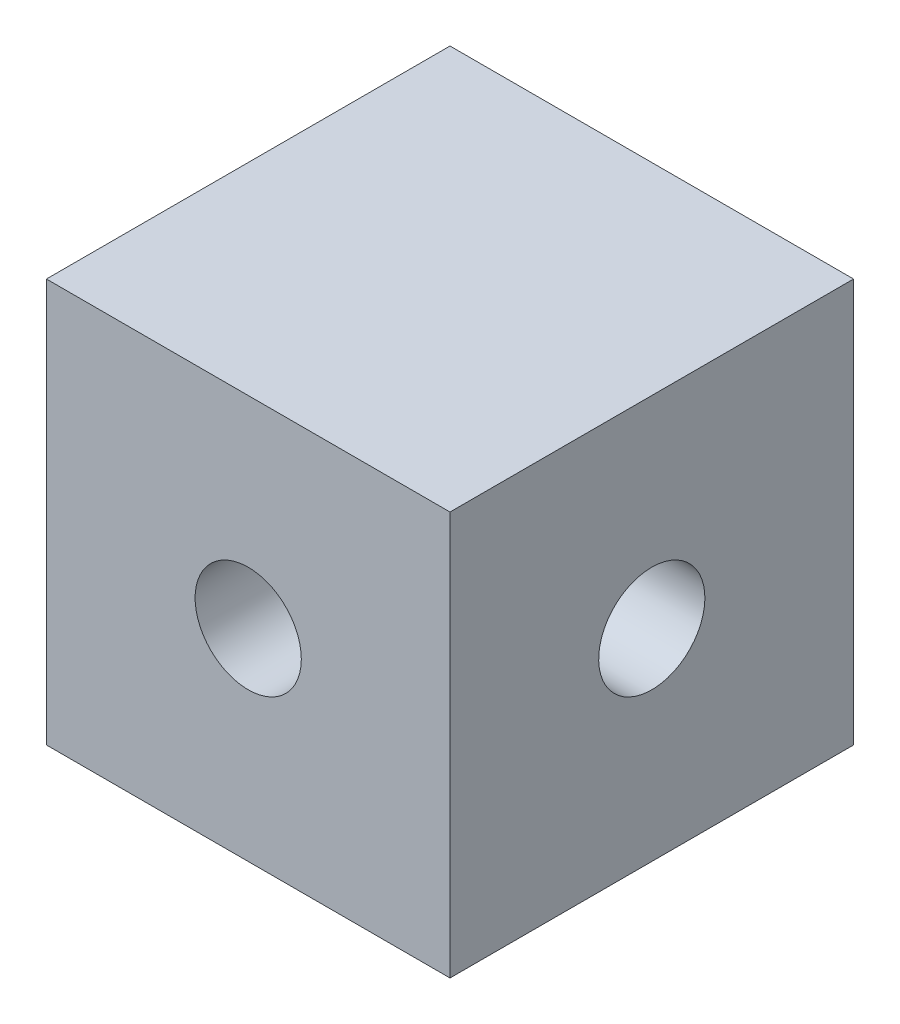
ISO-10303-21;
HEADER;
FILE_DESCRIPTION(('STEP AP214'),'2;1');
FILE_NAME('part.step','',(''),(''),'','','');
FILE_SCHEMA(('AUTOMOTIVE_DESIGN { 1 0 10303 214 1 1 1 1 }'));
ENDSEC;
DATA;
#1=APPLICATION_CONTEXT('core data for automotive mechanical design processes');
#2=APPLICATION_PROTOCOL_DEFINITION('international standard','automotive_design',2000,#1);
#3=PRODUCT_CONTEXT('',#1,'mechanical');
#4=PRODUCT('Part','Part','',(#3));
#5=PRODUCT_RELATED_PRODUCT_CATEGORY('part','',(#4));
#6=PRODUCT_DEFINITION_FORMATION('','',#4);
#7=PRODUCT_DEFINITION_CONTEXT('part definition',#1,'design');
#8=PRODUCT_DEFINITION('design','',#6,#7);
#9=PRODUCT_DEFINITION_SHAPE('','',#8);
#10=(LENGTH_UNIT() NAMED_UNIT(*) SI_UNIT(.MILLI.,.METRE.));
#11=(NAMED_UNIT(*) PLANE_ANGLE_UNIT() SI_UNIT($,.RADIAN.));
#12=(NAMED_UNIT(*) SI_UNIT($,.STERADIAN.) SOLID_ANGLE_UNIT());
#13=UNCERTAINTY_MEASURE_WITH_UNIT(LENGTH_MEASURE(1.E-05),#10,'distance_accuracy_value','');
#14=(GEOMETRIC_REPRESENTATION_CONTEXT(3) GLOBAL_UNCERTAINTY_ASSIGNED_CONTEXT((#13)) GLOBAL_UNIT_ASSIGNED_CONTEXT((#10,
#11,#12)) REPRESENTATION_CONTEXT('',''));
#15=CARTESIAN_POINT('',(0.,0.,0.));
#16=DIRECTION('',(0.,0.,1.));
#17=DIRECTION('',(1.,0.,0.));
#18=AXIS2_PLACEMENT_3D('',#15,#16,#17);
#19=CARTESIAN_POINT('',(0.,0.,-15.5));
#20=DIRECTION('',(0.,0.,1.));
#21=DIRECTION('',(1.,0.,0.));
#22=AXIS2_PLACEMENT_3D('',#19,#20,#21);
#23=CYLINDRICAL_SURFACE('',#22,2.5);
#24=CARTESIAN_POINT('',(0.,0.,9.5));
#25=DIRECTION('',(0.,0.,1.));
#26=DIRECTION('',(1.,0.,0.));
#27=AXIS2_PLACEMENT_3D('',#24,#25,#26);
#28=CIRCLE('',#27,2.5);
#29=CARTESIAN_POINT('',(2.5,0.,9.5));
#30=VERTEX_POINT('',#29);
#31=EDGE_CURVE('E118',#30,#30,#28,.T.);
#32=ORIENTED_EDGE('',*,*,#31,.T.);
#33=EDGE_LOOP('',(#32));
#34=FACE_BOUND('',#33,.T.);
#35=CARTESIAN_POINT('',(0.,0.,0.));
#36=DIRECTION('',(-0.707106781186547,0.,0.707106781186547));
#37=DIRECTION('',(0.707106781186547,0.,0.707106781186547));
#38=AXIS2_PLACEMENT_3D('',#35,#36,#37);
#39=ELLIPSE('',#38,3.53553390593274,2.5);
#40=CARTESIAN_POINT('',(0.,2.5,0.));
#41=VERTEX_POINT('',#40);
#42=CARTESIAN_POINT('',(0.,-2.5,0.));
#43=VERTEX_POINT('',#42);
#44=EDGE_CURVE('E53',#41,#43,#39,.F.);
#45=ORIENTED_EDGE('',*,*,#44,.T.);
#46=CARTESIAN_POINT('',(0.,0.,0.));
#47=DIRECTION('',(0.707106781186547,0.,0.707106781186547));
#48=DIRECTION('',(-0.707106781186547,0.,0.707106781186547));
#49=AXIS2_PLACEMENT_3D('',#46,#47,#48);
#50=ELLIPSE('',#49,3.53553390593274,2.5);
#51=EDGE_CURVE('E11',#43,#41,#50,.F.);
#52=ORIENTED_EDGE('',*,*,#51,.T.);
#53=EDGE_LOOP('',(#45,#52));
#54=FACE_BOUND('',#53,.T.);
#55=ADVANCED_FACE('F39',(#34,#54),#23,.F.);
#56=CARTESIAN_POINT('',(9.5,9.5,9.5));
#57=DIRECTION('',(-1.,0.,0.));
#58=DIRECTION('',(0.,-1.,0.));
#59=AXIS2_PLACEMENT_3D('',#56,#57,#58);
#60=PLANE('',#59);
#61=CARTESIAN_POINT('',(9.5,0.,0.));
#62=DIRECTION('',(1.,0.,0.));
#63=DIRECTION('',(0.,1.,0.));
#64=AXIS2_PLACEMENT_3D('',#61,#62,#63);
#65=CIRCLE('',#64,2.5);
#66=CARTESIAN_POINT('',(9.5,2.5,0.));
#67=VERTEX_POINT('',#66);
#68=EDGE_CURVE('E159',#67,#67,#65,.T.);
#69=ORIENTED_EDGE('',*,*,#68,.F.);
#70=EDGE_LOOP('',(#69));
#71=FACE_BOUND('',#70,.T.);
#72=DIRECTION('',(0.,1.,0.));
#73=VECTOR('',#72,1.);
#74=CARTESIAN_POINT('',(9.5,9.5,-9.5));
#75=LINE('',#74,#73);
#76=CARTESIAN_POINT('',(9.5,-9.5,-9.5));
#77=VERTEX_POINT('',#76);
#78=CARTESIAN_POINT('',(9.5,9.5,-9.5));
#79=VERTEX_POINT('',#78);
#80=EDGE_CURVE('E117',#77,#79,#75,.T.);
#81=ORIENTED_EDGE('',*,*,#80,.T.);
#82=DIRECTION('',(0.,0.,-1.));
#83=VECTOR('',#82,1.);
#84=CARTESIAN_POINT('',(9.5,9.5,9.5));
#85=LINE('',#84,#83);
#86=CARTESIAN_POINT('',(9.5,9.5,9.5));
#87=VERTEX_POINT('',#86);
#88=EDGE_CURVE('E107',#87,#79,#85,.T.);
#89=ORIENTED_EDGE('',*,*,#88,.F.);
#90=DIRECTION('',(0.,1.,0.));
#91=VECTOR('',#90,1.);
#92=CARTESIAN_POINT('',(9.5,9.5,9.5));
#93=LINE('',#92,#91);
#94=CARTESIAN_POINT('',(9.5,-9.5,9.5));
#95=VERTEX_POINT('',#94);
#96=EDGE_CURVE('E133',#95,#87,#93,.T.);
#97=ORIENTED_EDGE('',*,*,#96,.F.);
#98=DIRECTION('',(0.,0.,-1.));
#99=VECTOR('',#98,1.);
#100=CARTESIAN_POINT('',(9.5,-9.5,9.5));
#101=LINE('',#100,#99);
#102=EDGE_CURVE('E128',#95,#77,#101,.T.);
#103=ORIENTED_EDGE('',*,*,#102,.T.);
#104=EDGE_LOOP('',(#81,#89,#97,#103));
#105=FACE_BOUND('',#104,.T.);
#106=ADVANCED_FACE('F41',(#71,#105),#60,.F.);
#107=CARTESIAN_POINT('',(-9.5,9.5,9.5));
#108=DIRECTION('',(0.,-1.,0.));
#109=DIRECTION('',(0.,0.,-1.));
#110=AXIS2_PLACEMENT_3D('',#107,#108,#109);
#111=PLANE('',#110);
#112=DIRECTION('',(-1.,0.,0.));
#113=VECTOR('',#112,1.);
#114=CARTESIAN_POINT('',(-9.5,9.5,-9.5));
#115=LINE('',#114,#113);
#116=CARTESIAN_POINT('',(-9.5,9.5,-9.5));
#117=VERTEX_POINT('',#116);
#118=EDGE_CURVE('E137',#79,#117,#115,.T.);
#119=ORIENTED_EDGE('',*,*,#118,.T.);
#120=DIRECTION('',(0.,0.,-1.));
#121=VECTOR('',#120,1.);
#122=CARTESIAN_POINT('',(-9.5,9.5,9.5));
#123=LINE('',#122,#121);
#124=CARTESIAN_POINT('',(-9.5,9.5,9.5));
#125=VERTEX_POINT('',#124);
#126=EDGE_CURVE('E121',#125,#117,#123,.T.);
#127=ORIENTED_EDGE('',*,*,#126,.F.);
#128=DIRECTION('',(-1.,0.,0.));
#129=VECTOR('',#128,1.);
#130=CARTESIAN_POINT('',(-9.5,9.5,9.5));
#131=LINE('',#130,#129);
#132=EDGE_CURVE('E91',#87,#125,#131,.T.);
#133=ORIENTED_EDGE('',*,*,#132,.F.);
#134=ORIENTED_EDGE('',*,*,#88,.T.);
#135=EDGE_LOOP('',(#119,#127,#133,#134));
#136=FACE_BOUND('',#135,.T.);
#137=ADVANCED_FACE('F167',(#136),#111,.F.);
#138=CARTESIAN_POINT('',(-9.5,9.5,9.5));
#139=DIRECTION('',(1.,0.,0.));
#140=DIRECTION('',(0.,1.,0.));
#141=AXIS2_PLACEMENT_3D('',#138,#139,#140);
#142=PLANE('',#141);
#143=CARTESIAN_POINT('',(-9.5,0.,0.));
#144=DIRECTION('',(1.,0.,0.));
#145=DIRECTION('',(0.,1.,0.));
#146=AXIS2_PLACEMENT_3D('',#143,#144,#145);
#147=CIRCLE('',#146,2.5);
#148=CARTESIAN_POINT('',(-9.5,2.49999999999999,0.));
#149=VERTEX_POINT('',#148);
#150=EDGE_CURVE('E155',#149,#149,#147,.T.);
#151=ORIENTED_EDGE('',*,*,#150,.T.);
#152=EDGE_LOOP('',(#151));
#153=FACE_BOUND('',#152,.T.);
#154=DIRECTION('',(0.,-1.,0.));
#155=VECTOR('',#154,1.);
#156=CARTESIAN_POINT('',(-9.5,9.5,-9.5));
#157=LINE('',#156,#155);
#158=CARTESIAN_POINT('',(-9.5,-9.5,-9.5));
#159=VERTEX_POINT('',#158);
#160=EDGE_CURVE('E134',#117,#159,#157,.T.);
#161=ORIENTED_EDGE('',*,*,#160,.T.);
#162=DIRECTION('',(0.,0.,-1.));
#163=VECTOR('',#162,1.);
#164=CARTESIAN_POINT('',(-9.5,-9.5,9.5));
#165=LINE('',#164,#163);
#166=CARTESIAN_POINT('',(-9.5,-9.5,9.5));
#167=VERTEX_POINT('',#166);
#168=EDGE_CURVE('E125',#167,#159,#165,.T.);
#169=ORIENTED_EDGE('',*,*,#168,.F.);
#170=DIRECTION('',(0.,-1.,0.));
#171=VECTOR('',#170,1.);
#172=CARTESIAN_POINT('',(-9.5,9.5,9.5));
#173=LINE('',#172,#171);
#174=EDGE_CURVE('E145',#125,#167,#173,.T.);
#175=ORIENTED_EDGE('',*,*,#174,.F.);
#176=ORIENTED_EDGE('',*,*,#126,.T.);
#177=EDGE_LOOP('',(#161,#169,#175,#176));
#178=FACE_BOUND('',#177,.T.);
#179=ADVANCED_FACE('F175',(#153,#178),#142,.F.);
#180=CARTESIAN_POINT('',(-9.5,-9.5,9.5));
#181=DIRECTION('',(0.,1.,0.));
#182=DIRECTION('',(0.,0.,1.));
#183=AXIS2_PLACEMENT_3D('',#180,#181,#182);
#184=PLANE('',#183);
#185=DIRECTION('',(1.,0.,0.));
#186=VECTOR('',#185,1.);
#187=CARTESIAN_POINT('',(-9.5,-9.5,-9.5));
#188=LINE('',#187,#186);
#189=EDGE_CURVE('E83',#159,#77,#188,.T.);
#190=ORIENTED_EDGE('',*,*,#189,.T.);
#191=ORIENTED_EDGE('',*,*,#102,.F.);
#192=DIRECTION('',(1.,0.,0.));
#193=VECTOR('',#192,1.);
#194=CARTESIAN_POINT('',(-9.5,-9.5,9.5));
#195=LINE('',#194,#193);
#196=EDGE_CURVE('E62',#167,#95,#195,.T.);
#197=ORIENTED_EDGE('',*,*,#196,.F.);
#198=ORIENTED_EDGE('',*,*,#168,.T.);
#199=EDGE_LOOP('',(#190,#191,#197,#198));
#200=FACE_BOUND('',#199,.T.);
#201=ADVANCED_FACE('F179',(#200),#184,.F.);
#202=CARTESIAN_POINT('',(0.,0.,9.5));
#203=DIRECTION('',(0.,0.,1.));
#204=DIRECTION('',(1.,0.,0.));
#205=AXIS2_PLACEMENT_3D('',#202,#203,#204);
#206=PLANE('',#205);
#207=ORIENTED_EDGE('',*,*,#31,.F.);
#208=EDGE_LOOP('',(#207));
#209=FACE_BOUND('',#208,.T.);
#210=ORIENTED_EDGE('',*,*,#96,.T.);
#211=ORIENTED_EDGE('',*,*,#132,.T.);
#212=ORIENTED_EDGE('',*,*,#174,.T.);
#213=ORIENTED_EDGE('',*,*,#196,.T.);
#214=EDGE_LOOP('',(#210,#211,#212,#213));
#215=FACE_BOUND('',#214,.T.);
#216=ADVANCED_FACE('F194',(#209,#215),#206,.T.);
#217=CARTESIAN_POINT('',(0.,0.,-9.5));
#218=DIRECTION('',(0.,0.,1.));
#219=DIRECTION('',(1.,0.,0.));
#220=AXIS2_PLACEMENT_3D('',#217,#218,#219);
#221=PLANE('',#220);
#222=CARTESIAN_POINT('',(0.,0.,-9.5));
#223=DIRECTION('',(0.,0.,1.));
#224=DIRECTION('',(1.,0.,0.));
#225=AXIS2_PLACEMENT_3D('',#222,#223,#224);
#226=CIRCLE('',#225,2.5);
#227=CARTESIAN_POINT('',(2.5,0.,-9.5));
#228=VERTEX_POINT('',#227);
#229=EDGE_CURVE('E113',#228,#228,#226,.T.);
#230=ORIENTED_EDGE('',*,*,#229,.T.);
#231=EDGE_LOOP('',(#230));
#232=FACE_BOUND('',#231,.T.);
#233=ORIENTED_EDGE('',*,*,#80,.F.);
#234=ORIENTED_EDGE('',*,*,#189,.F.);
#235=ORIENTED_EDGE('',*,*,#160,.F.);
#236=ORIENTED_EDGE('',*,*,#118,.F.);
#237=EDGE_LOOP('',(#233,#234,#235,#236));
#238=FACE_BOUND('',#237,.T.);
#239=ADVANCED_FACE('F172',(#232,#238),#221,.F.);
#240=CARTESIAN_POINT('',(0.,0.,0.));
#241=DIRECTION('',(-0.707106781186547,0.,0.707106781186547));
#242=DIRECTION('',(0.707106781186547,0.,0.707106781186547));
#243=AXIS2_PLACEMENT_3D('',#240,#241,#242);
#244=ELLIPSE('',#243,3.53553390593274,2.5);
#245=EDGE_CURVE('E97',#41,#43,#244,.T.);
#246=ORIENTED_EDGE('',*,*,#245,.T.);
#247=CARTESIAN_POINT('',(0.,0.,0.));
#248=DIRECTION('',(0.707106781186547,0.,0.707106781186547));
#249=DIRECTION('',(-0.707106781186547,0.,0.707106781186547));
#250=AXIS2_PLACEMENT_3D('',#247,#248,#249);
#251=ELLIPSE('',#250,3.53553390593274,2.5);
#252=EDGE_CURVE('E48',#43,#41,#251,.T.);
#253=ORIENTED_EDGE('',*,*,#252,.T.);
#254=EDGE_LOOP('',(#246,#253));
#255=FACE_BOUND('',#254,.T.);
#256=ORIENTED_EDGE('',*,*,#229,.F.);
#257=EDGE_LOOP('',(#256));
#258=FACE_BOUND('',#257,.T.);
#259=ADVANCED_FACE('F109',(#255,#258),#23,.F.);
#260=CARTESIAN_POINT('',(-15.5,0.,0.));
#261=DIRECTION('',(1.,0.,0.));
#262=DIRECTION('',(0.,1.,0.));
#263=AXIS2_PLACEMENT_3D('',#260,#261,#262);
#264=CYLINDRICAL_SURFACE('',#263,2.5);
#265=ORIENTED_EDGE('',*,*,#68,.T.);
#266=EDGE_LOOP('',(#265));
#267=FACE_BOUND('',#266,.T.);
#268=ORIENTED_EDGE('',*,*,#44,.F.);
#269=ORIENTED_EDGE('',*,*,#252,.F.);
#270=EDGE_LOOP('',(#268,#269));
#271=FACE_BOUND('',#270,.T.);
#272=ADVANCED_FACE('F105',(#267,#271),#264,.F.);
#273=ORIENTED_EDGE('',*,*,#245,.F.);
#274=ORIENTED_EDGE('',*,*,#51,.F.);
#275=EDGE_LOOP('',(#273,#274));
#276=FACE_BOUND('',#275,.T.);
#277=ORIENTED_EDGE('',*,*,#150,.F.);
#278=EDGE_LOOP('',(#277));
#279=FACE_BOUND('',#278,.T.);
#280=ADVANCED_FACE('F98',(#276,#279),#264,.F.);
#281=CLOSED_SHELL('',(#55,#106,#137,#179,#201,#216,#239,#259,#272,#280));
#282=MANIFOLD_SOLID_BREP('B2',#281);
#283=ADVANCED_BREP_SHAPE_REPRESENTATION('',(#18,#282),#14);
#284=SHAPE_DEFINITION_REPRESENTATION(#9,#283);
ENDSEC;
END-ISO-10303-21;
